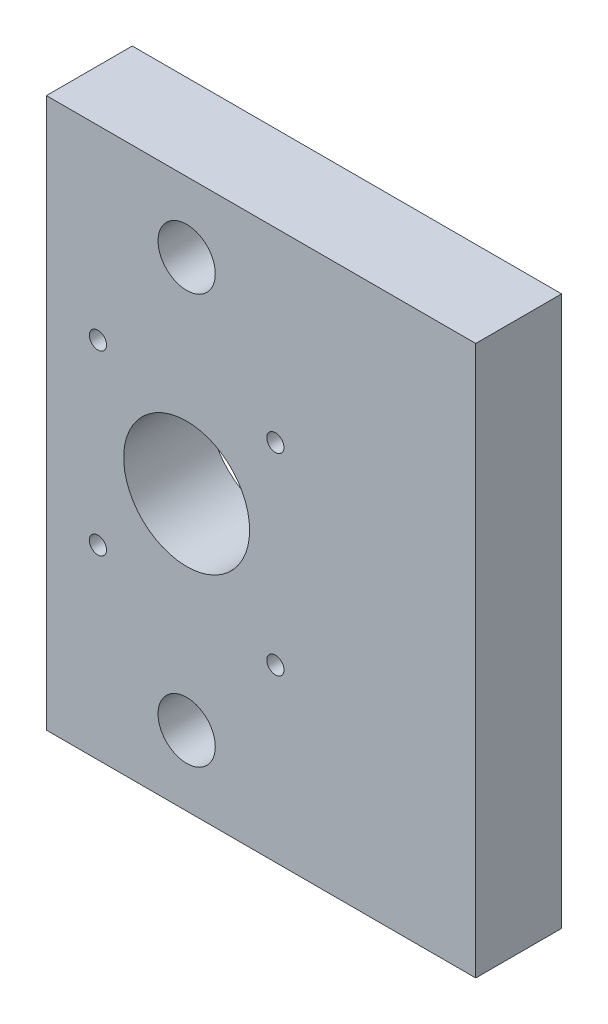
ISO-10303-21;
HEADER;
FILE_DESCRIPTION(('STEP AP214'),'2;1');
FILE_NAME('part.step','',(''),(''),'','','');
FILE_SCHEMA(('AUTOMOTIVE_DESIGN { 1 0 10303 214 1 1 1 1 }'));
ENDSEC;
DATA;
#1=APPLICATION_CONTEXT('core data for automotive mechanical design processes');
#2=APPLICATION_PROTOCOL_DEFINITION('international standard','automotive_design',2000,#1);
#3=PRODUCT_CONTEXT('',#1,'mechanical');
#4=PRODUCT('Part','Part','',(#3));
#5=PRODUCT_RELATED_PRODUCT_CATEGORY('part','',(#4));
#6=PRODUCT_DEFINITION_FORMATION('','',#4);
#7=PRODUCT_DEFINITION_CONTEXT('part definition',#1,'design');
#8=PRODUCT_DEFINITION('design','',#6,#7);
#9=PRODUCT_DEFINITION_SHAPE('','',#8);
#10=(LENGTH_UNIT() NAMED_UNIT(*) SI_UNIT(.MILLI.,.METRE.));
#11=(NAMED_UNIT(*) PLANE_ANGLE_UNIT() SI_UNIT($,.RADIAN.));
#12=(NAMED_UNIT(*) SI_UNIT($,.STERADIAN.) SOLID_ANGLE_UNIT());
#13=UNCERTAINTY_MEASURE_WITH_UNIT(LENGTH_MEASURE(1.E-05),#10,'distance_accuracy_value','');
#14=(GEOMETRIC_REPRESENTATION_CONTEXT(3) GLOBAL_UNCERTAINTY_ASSIGNED_CONTEXT((#13)) GLOBAL_UNIT_ASSIGNED_CONTEXT((#10,
#11,#12)) REPRESENTATION_CONTEXT('',''));
#15=CARTESIAN_POINT('',(0.,0.,0.));
#16=DIRECTION('',(0.,0.,1.));
#17=DIRECTION('',(1.,0.,0.));
#18=AXIS2_PLACEMENT_3D('',#15,#16,#17);
#19=CARTESIAN_POINT('',(0.,0.,15.));
#20=DIRECTION('',(0.,0.,1.));
#21=DIRECTION('',(1.,0.,0.));
#22=AXIS2_PLACEMENT_3D('',#19,#20,#21);
#23=PLANE('',#22);
#24=CARTESIAN_POINT('',(-35.5,304.289844730052,15.));
#25=DIRECTION('',(0.,0.,1.));
#26=DIRECTION('',(1.,0.,0.));
#27=AXIS2_PLACEMENT_3D('',#24,#25,#26);
#28=CIRCLE('',#27,5.);
#29=CARTESIAN_POINT('',(-30.4999999999999,304.289844730052,15.));
#30=VERTEX_POINT('',#29);
#31=EDGE_CURVE('E136',#30,#30,#28,.T.);
#32=ORIENTED_EDGE('',*,*,#31,.F.);
#33=EDGE_LOOP('',(#32));
#34=FACE_BOUND('',#33,.T.);
#35=CARTESIAN_POINT('',(-20.,250.370749595905,15.));
#36=DIRECTION('',(0.,0.,1.));
#37=DIRECTION('',(1.,0.,0.));
#38=AXIS2_PLACEMENT_3D('',#35,#36,#37);
#39=CIRCLE('',#38,1.4999999999766);
#40=CARTESIAN_POINT('',(-18.5000000000234,250.370749595905,15.));
#41=VERTEX_POINT('',#40);
#42=EDGE_CURVE('E124',#41,#41,#39,.T.);
#43=ORIENTED_EDGE('',*,*,#42,.F.);
#44=EDGE_LOOP('',(#43));
#45=FACE_BOUND('',#44,.T.);
#46=CARTESIAN_POINT('',(-51.,253.009389187345,15.));
#47=DIRECTION('',(0.,0.,1.));
#48=DIRECTION('',(1.,0.,0.));
#49=AXIS2_PLACEMENT_3D('',#46,#47,#48);
#50=CIRCLE('',#49,1.50000000002615);
#51=CARTESIAN_POINT('',(-49.4999999999738,253.009389187345,15.));
#52=VERTEX_POINT('',#51);
#53=EDGE_CURVE('E112',#52,#52,#50,.T.);
#54=ORIENTED_EDGE('',*,*,#53,.F.);
#55=EDGE_LOOP('',(#54));
#56=FACE_BOUND('',#55,.T.);
#57=DIRECTION('',(0.,1.,0.));
#58=VECTOR('',#57,1.);
#59=CARTESIAN_POINT('',(15.,220.509389187345,15.));
#60=LINE('',#59,#58);
#61=CARTESIAN_POINT('',(15.,220.509389187345,15.));
#62=VERTEX_POINT('',#61);
#63=CARTESIAN_POINT('',(15.,316.509389187345,15.));
#64=VERTEX_POINT('',#63);
#65=EDGE_CURVE('E82',#62,#64,#60,.T.);
#66=ORIENTED_EDGE('',*,*,#65,.T.);
#67=DIRECTION('',(-1.,0.,0.));
#68=VECTOR('',#67,1.);
#69=CARTESIAN_POINT('',(15.,316.509389187345,15.));
#70=LINE('',#69,#68);
#71=CARTESIAN_POINT('',(-60.,316.509389187345,15.));
#72=VERTEX_POINT('',#71);
#73=EDGE_CURVE('E77',#64,#72,#70,.T.);
#74=ORIENTED_EDGE('',*,*,#73,.T.);
#75=DIRECTION('',(0.,-1.,0.));
#76=VECTOR('',#75,1.);
#77=CARTESIAN_POINT('',(-60.,220.509389187345,15.));
#78=LINE('',#77,#76);
#79=CARTESIAN_POINT('',(-60.,220.509389187345,15.));
#80=VERTEX_POINT('',#79);
#81=EDGE_CURVE('E80',#72,#80,#78,.T.);
#82=ORIENTED_EDGE('',*,*,#81,.T.);
#83=DIRECTION('',(1.,0.,0.));
#84=VECTOR('',#83,1.);
#85=CARTESIAN_POINT('',(15.,220.509389187345,15.));
#86=LINE('',#85,#84);
#87=EDGE_CURVE('E47',#80,#62,#86,.T.);
#88=ORIENTED_EDGE('',*,*,#87,.T.);
#89=EDGE_LOOP('',(#66,#74,#82,#88));
#90=FACE_BOUND('',#89,.T.);
#91=CARTESIAN_POINT('',(-51.,284.009389187345,15.));
#92=DIRECTION('',(0.,0.,1.));
#93=DIRECTION('',(1.,0.,0.));
#94=AXIS2_PLACEMENT_3D('',#91,#92,#93);
#95=CIRCLE('',#94,1.50000000002615);
#96=CARTESIAN_POINT('',(-49.4999999999738,284.009389187345,15.));
#97=VERTEX_POINT('',#96);
#98=EDGE_CURVE('E97',#97,#97,#95,.T.);
#99=ORIENTED_EDGE('',*,*,#98,.F.);
#100=EDGE_LOOP('',(#99));
#101=FACE_BOUND('',#100,.T.);
#102=CARTESIAN_POINT('',(-35.5,268.509389187345,15.));
#103=DIRECTION('',(0.,0.,1.));
#104=DIRECTION('',(1.,0.,0.));
#105=AXIS2_PLACEMENT_3D('',#102,#103,#104);
#106=CIRCLE('',#105,11.0000000000118);
#107=CARTESIAN_POINT('',(-24.4999999999882,268.509389187345,15.));
#108=VERTEX_POINT('',#107);
#109=EDGE_CURVE('E118',#108,#108,#106,.T.);
#110=ORIENTED_EDGE('',*,*,#109,.F.);
#111=EDGE_LOOP('',(#110));
#112=FACE_BOUND('',#111,.T.);
#113=CARTESIAN_POINT('',(-35.4999999999999,232.728933644638,15.));
#114=DIRECTION('',(0.,0.,1.));
#115=DIRECTION('',(1.,0.,0.));
#116=AXIS2_PLACEMENT_3D('',#113,#114,#115);
#117=CIRCLE('',#116,5.00000000000002);
#118=CARTESIAN_POINT('',(-30.4999999999999,232.728933644638,15.));
#119=VERTEX_POINT('',#118);
#120=EDGE_CURVE('E130',#119,#119,#117,.T.);
#121=ORIENTED_EDGE('',*,*,#120,.F.);
#122=EDGE_LOOP('',(#121));
#123=FACE_BOUND('',#122,.T.);
#124=CARTESIAN_POINT('',(-20.,284.009389187345,15.));
#125=DIRECTION('',(0.,0.,1.));
#126=DIRECTION('',(1.,0.,0.));
#127=AXIS2_PLACEMENT_3D('',#124,#125,#126);
#128=CIRCLE('',#127,1.50000000002617);
#129=CARTESIAN_POINT('',(-18.4999999999738,284.009389187345,15.));
#130=VERTEX_POINT('',#129);
#131=EDGE_CURVE('E142',#130,#130,#128,.T.);
#132=ORIENTED_EDGE('',*,*,#131,.F.);
#133=EDGE_LOOP('',(#132));
#134=FACE_BOUND('',#133,.T.);
#135=ADVANCED_FACE('F30',(#34,#45,#56,#90,#101,#112,#123,#134),#23,.T.);
#136=CARTESIAN_POINT('',(0.,0.,0.));
#137=DIRECTION('',(0.,0.,1.));
#138=DIRECTION('',(1.,0.,0.));
#139=AXIS2_PLACEMENT_3D('',#136,#137,#138);
#140=PLANE('',#139);
#141=DIRECTION('',(0.,1.,0.));
#142=VECTOR('',#141,1.);
#143=CARTESIAN_POINT('',(15.,220.509389187345,0.));
#144=LINE('',#143,#142);
#145=CARTESIAN_POINT('',(15.,220.509389187345,0.));
#146=VERTEX_POINT('',#145);
#147=CARTESIAN_POINT('',(15.,316.509389187345,0.));
#148=VERTEX_POINT('',#147);
#149=EDGE_CURVE('E94',#146,#148,#144,.T.);
#150=ORIENTED_EDGE('',*,*,#149,.F.);
#151=DIRECTION('',(1.,0.,0.));
#152=VECTOR('',#151,1.);
#153=CARTESIAN_POINT('',(15.,220.509389187345,0.));
#154=LINE('',#153,#152);
#155=CARTESIAN_POINT('',(-60.,220.509389187345,0.));
#156=VERTEX_POINT('',#155);
#157=EDGE_CURVE('E70',#156,#146,#154,.T.);
#158=ORIENTED_EDGE('',*,*,#157,.F.);
#159=DIRECTION('',(0.,-1.,0.));
#160=VECTOR('',#159,1.);
#161=CARTESIAN_POINT('',(-60.,220.509389187345,0.));
#162=LINE('',#161,#160);
#163=CARTESIAN_POINT('',(-60.,316.509389187345,0.));
#164=VERTEX_POINT('',#163);
#165=EDGE_CURVE('E64',#164,#156,#162,.T.);
#166=ORIENTED_EDGE('',*,*,#165,.F.);
#167=DIRECTION('',(-1.,0.,0.));
#168=VECTOR('',#167,1.);
#169=CARTESIAN_POINT('',(15.,316.509389187345,0.));
#170=LINE('',#169,#168);
#171=EDGE_CURVE('E86',#148,#164,#170,.T.);
#172=ORIENTED_EDGE('',*,*,#171,.F.);
#173=EDGE_LOOP('',(#150,#158,#166,#172));
#174=FACE_BOUND('',#173,.T.);
#175=CARTESIAN_POINT('',(-51.,284.009389187345,0.));
#176=DIRECTION('',(0.,0.,1.));
#177=DIRECTION('',(1.,0.,0.));
#178=AXIS2_PLACEMENT_3D('',#175,#176,#177);
#179=CIRCLE('',#178,1.50000000002615);
#180=CARTESIAN_POINT('',(-49.4999999999738,284.009389187345,0.));
#181=VERTEX_POINT('',#180);
#182=EDGE_CURVE('E109',#181,#181,#179,.T.);
#183=ORIENTED_EDGE('',*,*,#182,.T.);
#184=EDGE_LOOP('',(#183));
#185=FACE_BOUND('',#184,.T.);
#186=CARTESIAN_POINT('',(-51.,253.009389187345,0.));
#187=DIRECTION('',(0.,0.,1.));
#188=DIRECTION('',(1.,0.,0.));
#189=AXIS2_PLACEMENT_3D('',#186,#187,#188);
#190=CIRCLE('',#189,1.50000000002615);
#191=CARTESIAN_POINT('',(-49.4999999999738,253.009389187345,0.));
#192=VERTEX_POINT('',#191);
#193=EDGE_CURVE('E115',#192,#192,#190,.T.);
#194=ORIENTED_EDGE('',*,*,#193,.T.);
#195=EDGE_LOOP('',(#194));
#196=FACE_BOUND('',#195,.T.);
#197=CARTESIAN_POINT('',(-35.5,268.509389187345,0.));
#198=DIRECTION('',(0.,0.,1.));
#199=DIRECTION('',(1.,0.,0.));
#200=AXIS2_PLACEMENT_3D('',#197,#198,#199);
#201=CIRCLE('',#200,11.0000000000118);
#202=CARTESIAN_POINT('',(-24.4999999999882,268.509389187345,0.));
#203=VERTEX_POINT('',#202);
#204=EDGE_CURVE('E121',#203,#203,#201,.T.);
#205=ORIENTED_EDGE('',*,*,#204,.T.);
#206=EDGE_LOOP('',(#205));
#207=FACE_BOUND('',#206,.T.);
#208=CARTESIAN_POINT('',(-20.,250.370749595905,0.));
#209=DIRECTION('',(0.,0.,1.));
#210=DIRECTION('',(1.,0.,0.));
#211=AXIS2_PLACEMENT_3D('',#208,#209,#210);
#212=CIRCLE('',#211,1.4999999999766);
#213=CARTESIAN_POINT('',(-18.5000000000234,250.370749595905,0.));
#214=VERTEX_POINT('',#213);
#215=EDGE_CURVE('E127',#214,#214,#212,.T.);
#216=ORIENTED_EDGE('',*,*,#215,.T.);
#217=EDGE_LOOP('',(#216));
#218=FACE_BOUND('',#217,.T.);
#219=CARTESIAN_POINT('',(-35.4999999999999,232.728933644638,0.));
#220=DIRECTION('',(0.,0.,1.));
#221=DIRECTION('',(1.,0.,0.));
#222=AXIS2_PLACEMENT_3D('',#219,#220,#221);
#223=CIRCLE('',#222,5.00000000000002);
#224=CARTESIAN_POINT('',(-30.4999999999999,232.728933644638,0.));
#225=VERTEX_POINT('',#224);
#226=EDGE_CURVE('E133',#225,#225,#223,.T.);
#227=ORIENTED_EDGE('',*,*,#226,.T.);
#228=EDGE_LOOP('',(#227));
#229=FACE_BOUND('',#228,.T.);
#230=CARTESIAN_POINT('',(-35.5,304.289844730052,0.));
#231=DIRECTION('',(0.,0.,1.));
#232=DIRECTION('',(1.,0.,0.));
#233=AXIS2_PLACEMENT_3D('',#230,#231,#232);
#234=CIRCLE('',#233,5.);
#235=CARTESIAN_POINT('',(-30.4999999999999,304.289844730052,0.));
#236=VERTEX_POINT('',#235);
#237=EDGE_CURVE('E139',#236,#236,#234,.T.);
#238=ORIENTED_EDGE('',*,*,#237,.T.);
#239=EDGE_LOOP('',(#238));
#240=FACE_BOUND('',#239,.T.);
#241=CARTESIAN_POINT('',(-20.,284.009389187345,0.));
#242=DIRECTION('',(0.,0.,1.));
#243=DIRECTION('',(1.,0.,0.));
#244=AXIS2_PLACEMENT_3D('',#241,#242,#243);
#245=CIRCLE('',#244,1.50000000002617);
#246=CARTESIAN_POINT('',(-18.4999999999738,284.009389187345,0.));
#247=VERTEX_POINT('',#246);
#248=EDGE_CURVE('E145',#247,#247,#245,.T.);
#249=ORIENTED_EDGE('',*,*,#248,.T.);
#250=EDGE_LOOP('',(#249));
#251=FACE_BOUND('',#250,.T.);
#252=ADVANCED_FACE('F105',(#174,#185,#196,#207,#218,#229,#240,#251),#140,.F.);
#253=CARTESIAN_POINT('',(15.,220.509389187345,15.));
#254=DIRECTION('',(-1.,0.,0.));
#255=DIRECTION('',(0.,0.,1.));
#256=AXIS2_PLACEMENT_3D('',#253,#254,#255);
#257=PLANE('',#256);
#258=ORIENTED_EDGE('',*,*,#149,.T.);
#259=DIRECTION('',(0.,0.,-1.));
#260=VECTOR('',#259,1.);
#261=CARTESIAN_POINT('',(15.,316.509389187345,15.));
#262=LINE('',#261,#260);
#263=EDGE_CURVE('E11',#64,#148,#262,.T.);
#264=ORIENTED_EDGE('',*,*,#263,.F.);
#265=ORIENTED_EDGE('',*,*,#65,.F.);
#266=DIRECTION('',(0.,0.,-1.));
#267=VECTOR('',#266,1.);
#268=CARTESIAN_POINT('',(15.,220.509389187345,15.));
#269=LINE('',#268,#267);
#270=EDGE_CURVE('E90',#62,#146,#269,.T.);
#271=ORIENTED_EDGE('',*,*,#270,.T.);
#272=EDGE_LOOP('',(#258,#264,#265,#271));
#273=FACE_BOUND('',#272,.T.);
#274=ADVANCED_FACE('F32',(#273),#257,.F.);
#275=CARTESIAN_POINT('',(15.,316.509389187345,15.));
#276=DIRECTION('',(0.,-1.,0.));
#277=DIRECTION('',(0.,0.,-1.));
#278=AXIS2_PLACEMENT_3D('',#275,#276,#277);
#279=PLANE('',#278);
#280=ORIENTED_EDGE('',*,*,#171,.T.);
#281=DIRECTION('',(0.,0.,-1.));
#282=VECTOR('',#281,1.);
#283=CARTESIAN_POINT('',(-60.,316.509389187345,15.));
#284=LINE('',#283,#282);
#285=EDGE_CURVE('E39',#72,#164,#284,.T.);
#286=ORIENTED_EDGE('',*,*,#285,.F.);
#287=ORIENTED_EDGE('',*,*,#73,.F.);
#288=ORIENTED_EDGE('',*,*,#263,.T.);
#289=EDGE_LOOP('',(#280,#286,#287,#288));
#290=FACE_BOUND('',#289,.T.);
#291=ADVANCED_FACE('F85',(#290),#279,.F.);
#292=CARTESIAN_POINT('',(-60.,220.509389187345,15.));
#293=DIRECTION('',(1.,0.,0.));
#294=DIRECTION('',(0.,0.,-1.));
#295=AXIS2_PLACEMENT_3D('',#292,#293,#294);
#296=PLANE('',#295);
#297=ORIENTED_EDGE('',*,*,#165,.T.);
#298=DIRECTION('',(0.,0.,-1.));
#299=VECTOR('',#298,1.);
#300=CARTESIAN_POINT('',(-60.,220.509389187345,15.));
#301=LINE('',#300,#299);
#302=EDGE_CURVE('E87',#80,#156,#301,.T.);
#303=ORIENTED_EDGE('',*,*,#302,.F.);
#304=ORIENTED_EDGE('',*,*,#81,.F.);
#305=ORIENTED_EDGE('',*,*,#285,.T.);
#306=EDGE_LOOP('',(#297,#303,#304,#305));
#307=FACE_BOUND('',#306,.T.);
#308=ADVANCED_FACE('F88',(#307),#296,.F.);
#309=CARTESIAN_POINT('',(15.,220.509389187345,15.));
#310=DIRECTION('',(0.,1.,0.));
#311=DIRECTION('',(0.,0.,1.));
#312=AXIS2_PLACEMENT_3D('',#309,#310,#311);
#313=PLANE('',#312);
#314=ORIENTED_EDGE('',*,*,#157,.T.);
#315=ORIENTED_EDGE('',*,*,#270,.F.);
#316=ORIENTED_EDGE('',*,*,#87,.F.);
#317=ORIENTED_EDGE('',*,*,#302,.T.);
#318=EDGE_LOOP('',(#314,#315,#316,#317));
#319=FACE_BOUND('',#318,.T.);
#320=ADVANCED_FACE('F102',(#319),#313,.F.);
#321=CARTESIAN_POINT('',(-51.,284.009389187345,15.));
#322=DIRECTION('',(0.,0.,-1.));
#323=DIRECTION('',(-1.,0.,0.));
#324=AXIS2_PLACEMENT_3D('',#321,#322,#323);
#325=CYLINDRICAL_SURFACE('',#324,1.50000000002615);
#326=ORIENTED_EDGE('',*,*,#98,.T.);
#327=EDGE_LOOP('',(#326));
#328=FACE_BOUND('',#327,.T.);
#329=ORIENTED_EDGE('',*,*,#182,.F.);
#330=EDGE_LOOP('',(#329));
#331=FACE_BOUND('',#330,.T.);
#332=ADVANCED_FACE('F164',(#328,#331),#325,.F.);
#333=CARTESIAN_POINT('',(-51.,253.009389187345,15.));
#334=DIRECTION('',(0.,0.,-1.));
#335=DIRECTION('',(-1.,0.,0.));
#336=AXIS2_PLACEMENT_3D('',#333,#334,#335);
#337=CYLINDRICAL_SURFACE('',#336,1.50000000002615);
#338=ORIENTED_EDGE('',*,*,#53,.T.);
#339=EDGE_LOOP('',(#338));
#340=FACE_BOUND('',#339,.T.);
#341=ORIENTED_EDGE('',*,*,#193,.F.);
#342=EDGE_LOOP('',(#341));
#343=FACE_BOUND('',#342,.T.);
#344=ADVANCED_FACE('F210',(#340,#343),#337,.F.);
#345=CARTESIAN_POINT('',(-35.5,268.509389187345,15.));
#346=DIRECTION('',(0.,0.,-1.));
#347=DIRECTION('',(-1.,0.,0.));
#348=AXIS2_PLACEMENT_3D('',#345,#346,#347);
#349=CYLINDRICAL_SURFACE('',#348,11.0000000000118);
#350=ORIENTED_EDGE('',*,*,#109,.T.);
#351=EDGE_LOOP('',(#350));
#352=FACE_BOUND('',#351,.T.);
#353=ORIENTED_EDGE('',*,*,#204,.F.);
#354=EDGE_LOOP('',(#353));
#355=FACE_BOUND('',#354,.T.);
#356=ADVANCED_FACE('F218',(#352,#355),#349,.F.);
#357=CARTESIAN_POINT('',(-20.,250.370749595905,15.));
#358=DIRECTION('',(0.,0.,-1.));
#359=DIRECTION('',(-1.,0.,0.));
#360=AXIS2_PLACEMENT_3D('',#357,#358,#359);
#361=CYLINDRICAL_SURFACE('',#360,1.4999999999766);
#362=ORIENTED_EDGE('',*,*,#42,.T.);
#363=EDGE_LOOP('',(#362));
#364=FACE_BOUND('',#363,.T.);
#365=ORIENTED_EDGE('',*,*,#215,.F.);
#366=EDGE_LOOP('',(#365));
#367=FACE_BOUND('',#366,.T.);
#368=ADVANCED_FACE('F226',(#364,#367),#361,.F.);
#369=CARTESIAN_POINT('',(-35.4999999999999,232.728933644638,15.));
#370=DIRECTION('',(0.,0.,-1.));
#371=DIRECTION('',(-1.,0.,0.));
#372=AXIS2_PLACEMENT_3D('',#369,#370,#371);
#373=CYLINDRICAL_SURFACE('',#372,5.00000000000002);
#374=ORIENTED_EDGE('',*,*,#120,.T.);
#375=EDGE_LOOP('',(#374));
#376=FACE_BOUND('',#375,.T.);
#377=ORIENTED_EDGE('',*,*,#226,.F.);
#378=EDGE_LOOP('',(#377));
#379=FACE_BOUND('',#378,.T.);
#380=ADVANCED_FACE('F235',(#376,#379),#373,.F.);
#381=CARTESIAN_POINT('',(-35.5,304.289844730052,15.));
#382=DIRECTION('',(0.,0.,-1.));
#383=DIRECTION('',(-1.,0.,0.));
#384=AXIS2_PLACEMENT_3D('',#381,#382,#383);
#385=CYLINDRICAL_SURFACE('',#384,5.);
#386=ORIENTED_EDGE('',*,*,#31,.T.);
#387=EDGE_LOOP('',(#386));
#388=FACE_BOUND('',#387,.T.);
#389=ORIENTED_EDGE('',*,*,#237,.F.);
#390=EDGE_LOOP('',(#389));
#391=FACE_BOUND('',#390,.T.);
#392=ADVANCED_FACE('F244',(#388,#391),#385,.F.);
#393=CARTESIAN_POINT('',(-20.,284.009389187345,15.));
#394=DIRECTION('',(0.,0.,-1.));
#395=DIRECTION('',(-1.,0.,0.));
#396=AXIS2_PLACEMENT_3D('',#393,#394,#395);
#397=CYLINDRICAL_SURFACE('',#396,1.50000000002617);
#398=ORIENTED_EDGE('',*,*,#131,.T.);
#399=EDGE_LOOP('',(#398));
#400=FACE_BOUND('',#399,.T.);
#401=ORIENTED_EDGE('',*,*,#248,.F.);
#402=EDGE_LOOP('',(#401));
#403=FACE_BOUND('',#402,.T.);
#404=ADVANCED_FACE('F151',(#400,#403),#397,.F.);
#405=CLOSED_SHELL('',(#135,#252,#274,#291,#308,#320,#332,#344,#356,#368,#380,#392,#404));
#406=MANIFOLD_SOLID_BREP('B2',#405);
#407=ADVANCED_BREP_SHAPE_REPRESENTATION('',(#18,#406),#14);
#408=SHAPE_DEFINITION_REPRESENTATION(#9,#407);
ENDSEC;
END-ISO-10303-21;
